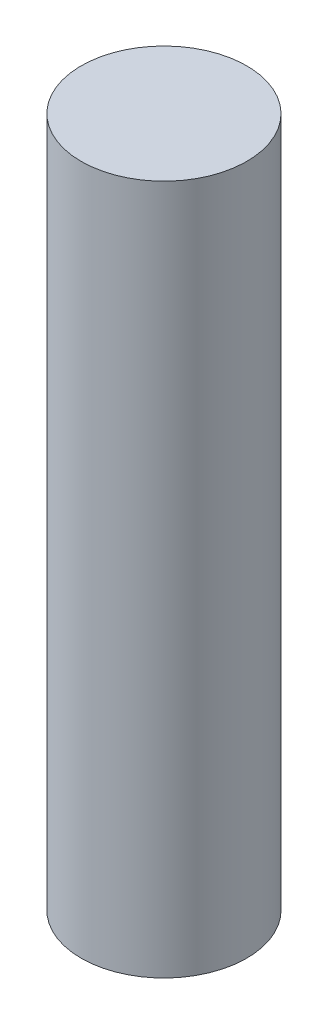
ISO-10303-21;
HEADER;
FILE_DESCRIPTION(('STEP AP214'),'2;1');
FILE_NAME('part.step','',(''),(''),'','','');
FILE_SCHEMA(('AUTOMOTIVE_DESIGN { 1 0 10303 214 1 1 1 1 }'));
ENDSEC;
DATA;
#1=APPLICATION_CONTEXT('core data for automotive mechanical design processes');
#2=APPLICATION_PROTOCOL_DEFINITION('international standard','automotive_design',2000,#1);
#3=PRODUCT_CONTEXT('',#1,'mechanical');
#4=PRODUCT('Part','Part','',(#3));
#5=PRODUCT_RELATED_PRODUCT_CATEGORY('part','',(#4));
#6=PRODUCT_DEFINITION_FORMATION('','',#4);
#7=PRODUCT_DEFINITION_CONTEXT('part definition',#1,'design');
#8=PRODUCT_DEFINITION('design','',#6,#7);
#9=PRODUCT_DEFINITION_SHAPE('','',#8);
#10=(LENGTH_UNIT() NAMED_UNIT(*) SI_UNIT(.MILLI.,.METRE.));
#11=(NAMED_UNIT(*) PLANE_ANGLE_UNIT() SI_UNIT($,.RADIAN.));
#12=(NAMED_UNIT(*) SI_UNIT($,.STERADIAN.) SOLID_ANGLE_UNIT());
#13=UNCERTAINTY_MEASURE_WITH_UNIT(LENGTH_MEASURE(1.E-05),#10,'distance_accuracy_value','');
#14=(GEOMETRIC_REPRESENTATION_CONTEXT(3) GLOBAL_UNCERTAINTY_ASSIGNED_CONTEXT((#13)) GLOBAL_UNIT_ASSIGNED_CONTEXT((#10,
#11,#12)) REPRESENTATION_CONTEXT('',''));
#15=CARTESIAN_POINT('',(0.,0.,0.));
#16=DIRECTION('',(0.,0.,1.));
#17=DIRECTION('',(1.,0.,0.));
#18=AXIS2_PLACEMENT_3D('',#15,#16,#17);
#19=CARTESIAN_POINT('',(0.,25.,0.));
#20=DIRECTION('',(0.,-1.,0.));
#21=DIRECTION('',(0.,0.,-1.));
#22=AXIS2_PLACEMENT_3D('',#19,#20,#21);
#23=CYLINDRICAL_SURFACE('',#22,6.);
#24=CARTESIAN_POINT('',(0.,25.,0.));
#25=DIRECTION('',(0.,1.,0.));
#26=DIRECTION('',(0.,0.,1.));
#27=AXIS2_PLACEMENT_3D('',#24,#25,#26);
#28=CIRCLE('',#27,6.);
#29=CARTESIAN_POINT('',(0.,25.,6.));
#30=VERTEX_POINT('',#29);
#31=EDGE_CURVE('E10',#30,#30,#28,.T.);
#32=ORIENTED_EDGE('',*,*,#31,.F.);
#33=EDGE_LOOP('',(#32));
#34=FACE_BOUND('',#33,.T.);
#35=CARTESIAN_POINT('',(0.,-25.,0.));
#36=DIRECTION('',(0.,1.,0.));
#37=DIRECTION('',(0.,0.,1.));
#38=AXIS2_PLACEMENT_3D('',#35,#36,#37);
#39=CIRCLE('',#38,6.);
#40=CARTESIAN_POINT('',(0.,-25.,6.));
#41=VERTEX_POINT('',#40);
#42=EDGE_CURVE('E34',#41,#41,#39,.T.);
#43=ORIENTED_EDGE('',*,*,#42,.T.);
#44=EDGE_LOOP('',(#43));
#45=FACE_BOUND('',#44,.T.);
#46=ADVANCED_FACE('F31',(#34,#45),#23,.T.);
#47=CARTESIAN_POINT('',(0.,25.,0.));
#48=DIRECTION('',(0.,1.,0.));
#49=DIRECTION('',(0.,0.,1.));
#50=AXIS2_PLACEMENT_3D('',#47,#48,#49);
#51=PLANE('',#50);
#52=ORIENTED_EDGE('',*,*,#31,.T.);
#53=EDGE_LOOP('',(#52));
#54=FACE_BOUND('',#53,.T.);
#55=ADVANCED_FACE('F46',(#54),#51,.T.);
#56=CARTESIAN_POINT('',(0.,-25.,0.));
#57=DIRECTION('',(0.,1.,0.));
#58=DIRECTION('',(0.,0.,1.));
#59=AXIS2_PLACEMENT_3D('',#56,#57,#58);
#60=PLANE('',#59);
#61=ORIENTED_EDGE('',*,*,#42,.F.);
#62=EDGE_LOOP('',(#61));
#63=FACE_BOUND('',#62,.T.);
#64=ADVANCED_FACE('F44',(#63),#60,.F.);
#65=CLOSED_SHELL('',(#46,#55,#64));
#66=MANIFOLD_SOLID_BREP('B2',#65);
#67=ADVANCED_BREP_SHAPE_REPRESENTATION('',(#18,#66),#14);
#68=SHAPE_DEFINITION_REPRESENTATION(#9,#67);
ENDSEC;
END-ISO-10303-21;
